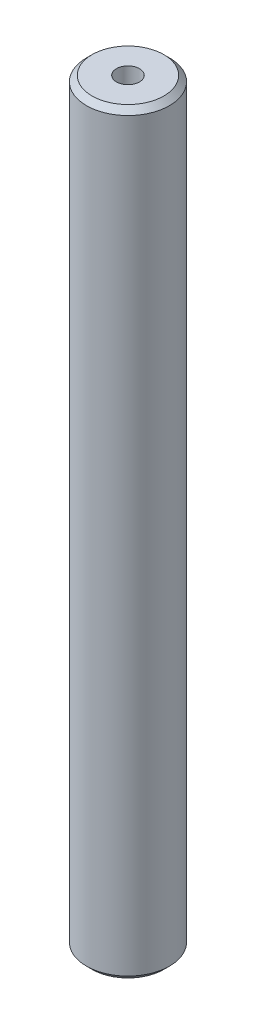
ISO-10303-21;
HEADER;
FILE_DESCRIPTION(('STEP AP214'),'2;1');
FILE_NAME('part.step','',(''),(''),'','','');
FILE_SCHEMA(('AUTOMOTIVE_DESIGN { 1 0 10303 214 1 1 1 1 }'));
ENDSEC;
DATA;
#1=APPLICATION_CONTEXT('core data for automotive mechanical design processes');
#2=APPLICATION_PROTOCOL_DEFINITION('international standard','automotive_design',2000,#1);
#3=PRODUCT_CONTEXT('',#1,'mechanical');
#4=PRODUCT('Part','Part','',(#3));
#5=PRODUCT_RELATED_PRODUCT_CATEGORY('part','',(#4));
#6=PRODUCT_DEFINITION_FORMATION('','',#4);
#7=PRODUCT_DEFINITION_CONTEXT('part definition',#1,'design');
#8=PRODUCT_DEFINITION('design','',#6,#7);
#9=PRODUCT_DEFINITION_SHAPE('','',#8);
#10=(LENGTH_UNIT() NAMED_UNIT(*) SI_UNIT(.MILLI.,.METRE.));
#11=(NAMED_UNIT(*) PLANE_ANGLE_UNIT() SI_UNIT($,.RADIAN.));
#12=(NAMED_UNIT(*) SI_UNIT($,.STERADIAN.) SOLID_ANGLE_UNIT());
#13=UNCERTAINTY_MEASURE_WITH_UNIT(LENGTH_MEASURE(1.E-05),#10,'distance_accuracy_value','');
#14=(GEOMETRIC_REPRESENTATION_CONTEXT(3) GLOBAL_UNCERTAINTY_ASSIGNED_CONTEXT((#13)) GLOBAL_UNIT_ASSIGNED_CONTEXT((#10,
#11,#12)) REPRESENTATION_CONTEXT('',''));
#15=CARTESIAN_POINT('',(0.,0.,0.));
#16=DIRECTION('',(0.,0.,1.));
#17=DIRECTION('',(1.,0.,0.));
#18=AXIS2_PLACEMENT_3D('',#15,#16,#17);
#19=CARTESIAN_POINT('',(0.,319.289414756355,0.));
#20=DIRECTION('',(0.,-1.,0.));
#21=DIRECTION('',(0.,0.,-1.));
#22=AXIS2_PLACEMENT_3D('',#19,#20,#21);
#23=CYLINDRICAL_SURFACE('',#22,17.5);
#24=CARTESIAN_POINT('',(0.,316.92968418507,0.));
#25=DIRECTION('',(0.,1.,0.));
#26=DIRECTION('',(0.,0.,1.));
#27=AXIS2_PLACEMENT_3D('',#24,#25,#26);
#28=CIRCLE('',#27,17.5);
#29=CARTESIAN_POINT('',(0.,316.92968418507,17.5));
#30=VERTEX_POINT('',#29);
#31=EDGE_CURVE('E50',#30,#30,#28,.F.);
#32=ORIENTED_EDGE('',*,*,#31,.T.);
#33=EDGE_LOOP('',(#32));
#34=FACE_BOUND('',#33,.T.);
#35=CARTESIAN_POINT('',(0.,2.35973057128491,0.));
#36=DIRECTION('',(0.,1.,0.));
#37=DIRECTION('',(0.,0.,1.));
#38=AXIS2_PLACEMENT_3D('',#35,#36,#37);
#39=CIRCLE('',#38,17.5);
#40=CARTESIAN_POINT('',(0.,2.35973057128491,17.5));
#41=VERTEX_POINT('',#40);
#42=EDGE_CURVE('E51',#41,#41,#39,.T.);
#43=ORIENTED_EDGE('',*,*,#42,.T.);
#44=EDGE_LOOP('',(#43));
#45=FACE_BOUND('',#44,.T.);
#46=ADVANCED_FACE('F39',(#34,#45),#23,.T.);
#47=CARTESIAN_POINT('',(0.,319.289414756355,0.));
#48=DIRECTION('',(0.,1.,0.));
#49=DIRECTION('',(0.,0.,1.));
#50=AXIS2_PLACEMENT_3D('',#47,#48,#49);
#51=PLANE('',#50);
#52=CARTESIAN_POINT('',(0.,319.289414756355,0.));
#53=DIRECTION('',(0.,1.,0.));
#54=DIRECTION('',(0.,0.,1.));
#55=AXIS2_PLACEMENT_3D('',#52,#53,#54);
#56=CIRCLE('',#55,15.140269428715);
#57=CARTESIAN_POINT('',(0.,319.289414756355,15.140269428715));
#58=VERTEX_POINT('',#57);
#59=EDGE_CURVE('E54',#58,#58,#56,.T.);
#60=ORIENTED_EDGE('',*,*,#59,.T.);
#61=EDGE_LOOP('',(#60));
#62=FACE_BOUND('',#61,.T.);
#63=CARTESIAN_POINT('',(0.,319.289414756355,0.));
#64=DIRECTION('',(0.,1.,0.));
#65=DIRECTION('',(0.,0.,1.));
#66=AXIS2_PLACEMENT_3D('',#63,#64,#65);
#67=CIRCLE('',#66,4.86782220273754);
#68=CARTESIAN_POINT('',(0.,319.289414756355,4.86782220273754));
#69=VERTEX_POINT('',#68);
#70=EDGE_CURVE('E58',#69,#69,#67,.T.);
#71=ORIENTED_EDGE('',*,*,#70,.F.);
#72=EDGE_LOOP('',(#71));
#73=FACE_BOUND('',#72,.T.);
#74=ADVANCED_FACE('F69',(#62,#73),#51,.T.);
#75=CARTESIAN_POINT('',(0.,0.,0.));
#76=DIRECTION('',(0.,1.,0.));
#77=DIRECTION('',(0.,0.,1.));
#78=AXIS2_PLACEMENT_3D('',#75,#76,#77);
#79=PLANE('',#78);
#80=CARTESIAN_POINT('',(0.,0.,0.));
#81=DIRECTION('',(0.,1.,0.));
#82=DIRECTION('',(0.,0.,1.));
#83=AXIS2_PLACEMENT_3D('',#80,#81,#82);
#84=CIRCLE('',#83,15.1402694287151);
#85=CARTESIAN_POINT('',(0.,0.,15.1402694287151));
#86=VERTEX_POINT('',#85);
#87=EDGE_CURVE('E10',#86,#86,#84,.F.);
#88=ORIENTED_EDGE('',*,*,#87,.T.);
#89=EDGE_LOOP('',(#88));
#90=FACE_BOUND('',#89,.T.);
#91=CARTESIAN_POINT('',(0.,0.,0.));
#92=DIRECTION('',(0.,1.,0.));
#93=DIRECTION('',(0.,0.,1.));
#94=AXIS2_PLACEMENT_3D('',#91,#92,#93);
#95=CIRCLE('',#94,4.86782220273754);
#96=CARTESIAN_POINT('',(0.,0.,4.86782220273754));
#97=VERTEX_POINT('',#96);
#98=EDGE_CURVE('E63',#97,#97,#95,.T.);
#99=ORIENTED_EDGE('',*,*,#98,.T.);
#100=EDGE_LOOP('',(#99));
#101=FACE_BOUND('',#100,.T.);
#102=ADVANCED_FACE('F75',(#90,#101),#79,.F.);
#103=CARTESIAN_POINT('',(0.,319.289414756355,0.));
#104=DIRECTION('',(0.,-1.,0.));
#105=DIRECTION('',(0.,0.,-1.));
#106=AXIS2_PLACEMENT_3D('',#103,#104,#105);
#107=CYLINDRICAL_SURFACE('',#106,4.86782220273754);
#108=ORIENTED_EDGE('',*,*,#70,.T.);
#109=EDGE_LOOP('',(#108));
#110=FACE_BOUND('',#109,.T.);
#111=ORIENTED_EDGE('',*,*,#98,.F.);
#112=EDGE_LOOP('',(#111));
#113=FACE_BOUND('',#112,.T.);
#114=ADVANCED_FACE('F70',(#110,#113),#107,.F.);
#115=CARTESIAN_POINT('',(0.,319.289414756355,0.));
#116=DIRECTION('',(0.,-1.,0.));
#117=DIRECTION('',(0.,0.,-1.));
#118=AXIS2_PLACEMENT_3D('',#115,#116,#117);
#119=CONICAL_SURFACE('',#118,15.140269428715,0.78539816339744);
#120=ORIENTED_EDGE('',*,*,#31,.F.);
#121=EDGE_LOOP('',(#120));
#122=FACE_BOUND('',#121,.T.);
#123=ORIENTED_EDGE('',*,*,#59,.F.);
#124=EDGE_LOOP('',(#123));
#125=FACE_BOUND('',#124,.T.);
#126=ADVANCED_FACE('F81',(#122,#125),#119,.T.);
#127=CARTESIAN_POINT('',(0.,2.35973057128491,0.));
#128=DIRECTION('',(0.,1.,0.));
#129=DIRECTION('',(0.,0.,1.));
#130=AXIS2_PLACEMENT_3D('',#127,#128,#129);
#131=CONICAL_SURFACE('',#130,17.5,0.785398163397446);
#132=ORIENTED_EDGE('',*,*,#87,.F.);
#133=EDGE_LOOP('',(#132));
#134=FACE_BOUND('',#133,.T.);
#135=ORIENTED_EDGE('',*,*,#42,.F.);
#136=EDGE_LOOP('',(#135));
#137=FACE_BOUND('',#136,.T.);
#138=ADVANCED_FACE('F45',(#134,#137),#131,.T.);
#139=CLOSED_SHELL('',(#46,#74,#102,#114,#126,#138));
#140=MANIFOLD_SOLID_BREP('B2',#139);
#141=ADVANCED_BREP_SHAPE_REPRESENTATION('',(#18,#140),#14);
#142=SHAPE_DEFINITION_REPRESENTATION(#9,#141);
ENDSEC;
END-ISO-10303-21;
